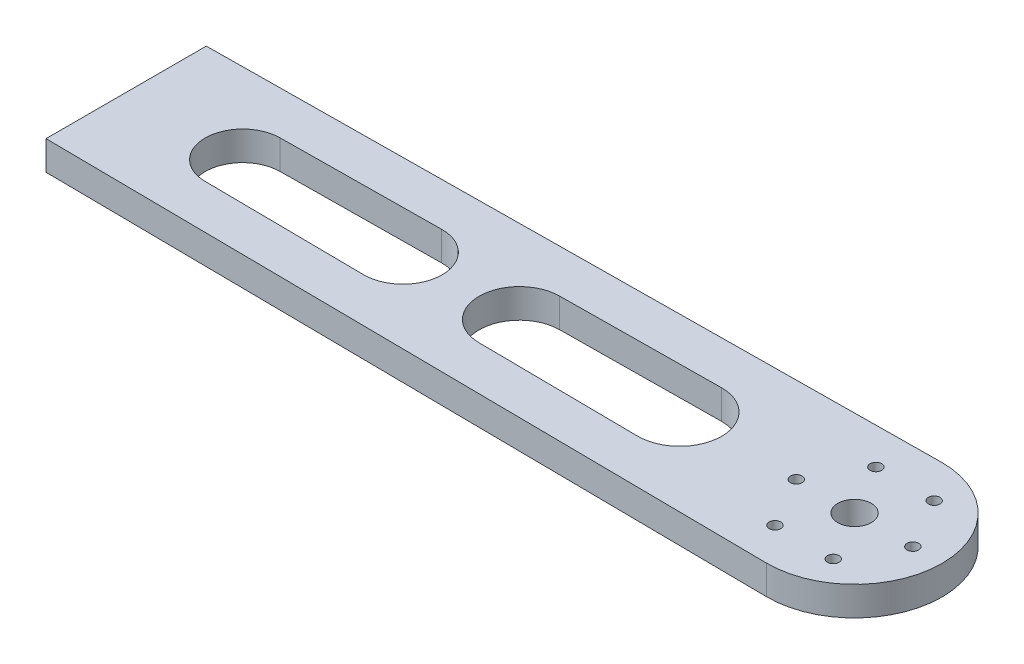
ISO-10303-21;
HEADER;
FILE_DESCRIPTION(('STEP AP214'),'2;1');
FILE_NAME('part.step','',(''),(''),'','','');
FILE_SCHEMA(('AUTOMOTIVE_DESIGN { 1 0 10303 214 1 1 1 1 }'));
ENDSEC;
DATA;
#1=APPLICATION_CONTEXT('core data for automotive mechanical design processes');
#2=APPLICATION_PROTOCOL_DEFINITION('international standard','automotive_design',2000,#1);
#3=PRODUCT_CONTEXT('',#1,'mechanical');
#4=PRODUCT('Part','Part','',(#3));
#5=PRODUCT_RELATED_PRODUCT_CATEGORY('part','',(#4));
#6=PRODUCT_DEFINITION_FORMATION('','',#4);
#7=PRODUCT_DEFINITION_CONTEXT('part definition',#1,'design');
#8=PRODUCT_DEFINITION('design','',#6,#7);
#9=PRODUCT_DEFINITION_SHAPE('','',#8);
#10=(LENGTH_UNIT() NAMED_UNIT(*) SI_UNIT(.MILLI.,.METRE.));
#11=(NAMED_UNIT(*) PLANE_ANGLE_UNIT() SI_UNIT($,.RADIAN.));
#12=(NAMED_UNIT(*) SI_UNIT($,.STERADIAN.) SOLID_ANGLE_UNIT());
#13=UNCERTAINTY_MEASURE_WITH_UNIT(LENGTH_MEASURE(1.E-05),#10,'distance_accuracy_value','');
#14=(GEOMETRIC_REPRESENTATION_CONTEXT(3) GLOBAL_UNCERTAINTY_ASSIGNED_CONTEXT((#13)) GLOBAL_UNIT_ASSIGNED_CONTEXT((#10,
#11,#12)) REPRESENTATION_CONTEXT('',''));
#15=CARTESIAN_POINT('',(0.,0.,0.));
#16=DIRECTION('',(0.,0.,1.));
#17=DIRECTION('',(1.,0.,0.));
#18=AXIS2_PLACEMENT_3D('',#15,#16,#17);
#19=CARTESIAN_POINT('',(33.6152394142152,10.,-9.95522460733301));
#20=DIRECTION('',(0.,1.,0.));
#21=DIRECTION('',(0.,0.,1.));
#22=AXIS2_PLACEMENT_3D('',#19,#20,#21);
#23=PLANE('',#22);
#24=DIRECTION('',(0.999948973181895,0.,0.0101020311063743));
#25=VECTOR('',#24,1.);
#26=CARTESIAN_POINT('',(-81.52466678409,10.,3.88233456528161));
#27=LINE('',#26,#25);
#28=CARTESIAN_POINT('',(-81.52466678409,10.,3.88233456528161));
#29=VERTEX_POINT('',#28);
#30=CARTESIAN_POINT('',(-26.5302262167507,10.,4.43791846424908));
#31=VERTEX_POINT('',#30);
#32=EDGE_CURVE('E132',#29,#31,#27,.T.);
#33=ORIENTED_EDGE('',*,*,#32,.F.);
#34=CARTESIAN_POINT('',(-81.3847600499998,10.,-9.96632553302472));
#35=DIRECTION('',(0.,1.,0.));
#36=DIRECTION('',(0.,0.,1.));
#37=AXIS2_PLACEMENT_3D('',#34,#35,#36);
#38=CIRCLE('',#37,13.8493667874263);
#39=CARTESIAN_POINT('',(-81.5219931650311,10.,-23.8150123835822));
#40=VERTEX_POINT('',#39);
#41=EDGE_CURVE('E124',#40,#29,#38,.T.);
#42=ORIENTED_EDGE('',*,*,#41,.F.);
#43=DIRECTION('',(-0.999950904840691,0.,0.00990898119298126));
#44=VECTOR('',#43,1.);
#45=CARTESIAN_POINT('',(-81.5219931650311,10.,-23.8150123835822));
#46=LINE('',#45,#44);
#47=CARTESIAN_POINT('',(-26.5274463617761,10.,-24.3599790687984));
#48=VERTEX_POINT('',#47);
#49=EDGE_CURVE('E147',#48,#40,#46,.T.);
#50=ORIENTED_EDGE('',*,*,#49,.F.);
#51=CARTESIAN_POINT('',(-26.3847603062448,10.,-9.96101639465042));
#52=DIRECTION('',(0.,1.,0.));
#53=DIRECTION('',(0.,0.,1.));
#54=AXIS2_PLACEMENT_3D('',#51,#52,#53);
#55=CIRCLE('',#54,14.3996696282224);
#56=EDGE_CURVE('E145',#31,#48,#55,.T.);
#57=ORIENTED_EDGE('',*,*,#56,.F.);
#58=EDGE_LOOP('',(#33,#42,#50,#57));
#59=FACE_BOUND('',#58,.T.);
#60=CARTESIAN_POINT('',(23.6152394142153,10.,-27.2757326830219));
#61=DIRECTION('',(0.,1.,0.));
#62=DIRECTION('',(0.,0.,1.));
#63=AXIS2_PLACEMENT_3D('',#60,#61,#62);
#64=CIRCLE('',#63,2.);
#65=CARTESIAN_POINT('',(23.6152394142153,10.,-25.2757326830219));
#66=VERTEX_POINT('',#65);
#67=EDGE_CURVE('E163',#66,#66,#64,.T.);
#68=ORIENTED_EDGE('',*,*,#67,.F.);
#69=EDGE_LOOP('',(#68));
#70=FACE_BOUND('',#69,.T.);
#71=CARTESIAN_POINT('',(23.6152394142151,10.,7.36528346835572));
#72=DIRECTION('',(0.,1.,0.));
#73=DIRECTION('',(0.,0.,1.));
#74=AXIS2_PLACEMENT_3D('',#71,#72,#73);
#75=CIRCLE('',#74,2.);
#76=CARTESIAN_POINT('',(23.6152394142151,10.,9.36528346835572));
#77=VERTEX_POINT('',#76);
#78=EDGE_CURVE('E175',#77,#77,#75,.T.);
#79=ORIENTED_EDGE('',*,*,#78,.F.);
#80=EDGE_LOOP('',(#79));
#81=FACE_BOUND('',#80,.T.);
#82=DIRECTION('',(-0.999950904840691,0.,0.00990898119298113));
#83=VECTOR('',#82,1.);
#84=CARTESIAN_POINT('',(-176.512574007017,10.,-22.873706290936));
#85=LINE('',#84,#83);
#86=CARTESIAN_POINT('',(-121.518027203762,10.,-23.4186729761523));
#87=VERTEX_POINT('',#86);
#88=CARTESIAN_POINT('',(-176.512574007017,10.,-22.873706290936));
#89=VERTEX_POINT('',#88);
#90=EDGE_CURVE('E189',#87,#89,#85,.T.);
#91=ORIENTED_EDGE('',*,*,#90,.F.);
#92=CARTESIAN_POINT('',(-121.38475986364,10.,-9.97018672456965));
#93=DIRECTION('',(0.,1.,0.));
#94=DIRECTION('',(0.,0.,1.));
#95=AXIS2_PLACEMENT_3D('',#92,#93,#94);
#96=CIRCLE('',#95,13.4491465395745);
#97=CARTESIAN_POINT('',(-121.520623560337,10.,3.47827354785072));
#98=VERTEX_POINT('',#97);
#99=EDGE_CURVE('E187',#98,#87,#96,.T.);
#100=ORIENTED_EDGE('',*,*,#99,.F.);
#101=DIRECTION('',(0.999948973181895,0.,0.0101020311063743));
#102=VECTOR('',#101,1.);
#103=CARTESIAN_POINT('',(-176.515064127676,10.,2.92268964888325));
#104=LINE('',#103,#102);
#105=CARTESIAN_POINT('',(-176.515064127676,10.,2.92268964888325));
#106=VERTEX_POINT('',#105);
#107=EDGE_CURVE('E195',#106,#98,#104,.T.);
#108=ORIENTED_EDGE('',*,*,#107,.F.);
#109=CARTESIAN_POINT('',(-176.384759607395,10.,-9.97549586294395));
#110=DIRECTION('',(0.,1.,0.));
#111=DIRECTION('',(0.,0.,1.));
#112=AXIS2_PLACEMENT_3D('',#109,#110,#111);
#113=CIRCLE('',#112,12.8988436987784);
#114=EDGE_CURVE('E192',#89,#106,#113,.T.);
#115=ORIENTED_EDGE('',*,*,#114,.F.);
#116=EDGE_LOOP('',(#91,#100,#108,#115));
#117=FACE_BOUND('',#116,.T.);
#118=CARTESIAN_POINT('',(53.6152394142152,10.,-9.95522460733301));
#119=DIRECTION('',(0.,1.,0.));
#120=DIRECTION('',(0.,0.,1.));
#121=AXIS2_PLACEMENT_3D('',#118,#119,#120);
#122=CIRCLE('',#121,2.);
#123=CARTESIAN_POINT('',(53.6152394142152,10.,-7.95522460733301));
#124=VERTEX_POINT('',#123);
#125=EDGE_CURVE('E218',#124,#124,#122,.T.);
#126=ORIENTED_EDGE('',*,*,#125,.F.);
#127=EDGE_LOOP('',(#126));
#128=FACE_BOUND('',#127,.T.);
#129=DIRECTION('',(-9.65297886194745E-05,0.,0.999999995341));
#130=VECTOR('',#129,1.);
#131=CARTESIAN_POINT('',(-216.382104851848,10.,-37.4793569263664));
#132=LINE('',#131,#130);
#133=CARTESIAN_POINT('',(-216.382104851848,10.,-37.4793569263664));
#134=VERTEX_POINT('',#133);
#135=CARTESIAN_POINT('',(-216.387413990222,10.,17.5206428173886));
#136=VERTEX_POINT('',#135);
#137=EDGE_CURVE('E230',#134,#136,#132,.T.);
#138=ORIENTED_EDGE('',*,*,#137,.T.);
#139=DIRECTION('',(0.999948973181895,0.,0.0101020311063743));
#140=VECTOR('',#139,1.);
#141=CARTESIAN_POINT('',(-216.387413990222,10.,17.5206428173886));
#142=LINE('',#141,#140);
#143=CARTESIAN_POINT('',(33.3121784810239,10.,20.0432445881238));
#144=VERTEX_POINT('',#143);
#145=EDGE_CURVE('E233',#136,#144,#142,.T.);
#146=ORIENTED_EDGE('',*,*,#145,.T.);
#147=CARTESIAN_POINT('',(33.6152394142152,10.,-9.95522460733301));
#148=DIRECTION('',(0.,1.,0.));
#149=DIRECTION('',(0.,0.,1.));
#150=AXIS2_PLACEMENT_3D('',#147,#148,#149);
#151=CIRCLE('',#150,30.);
#152=CARTESIAN_POINT('',(33.3179699784257,10.,-39.9537517525538));
#153=VERTEX_POINT('',#152);
#154=EDGE_CURVE('E236',#144,#153,#151,.T.);
#155=ORIENTED_EDGE('',*,*,#154,.T.);
#156=DIRECTION('',(-0.999950904840691,0.,0.00990898119298121));
#157=VECTOR('',#156,1.);
#158=CARTESIAN_POINT('',(-216.382104851848,10.,-37.4793569263664));
#159=LINE('',#158,#157);
#160=EDGE_CURVE('E238',#153,#134,#159,.T.);
#161=ORIENTED_EDGE('',*,*,#160,.T.);
#162=EDGE_LOOP('',(#138,#146,#155,#161));
#163=FACE_BOUND('',#162,.T.);
#164=CARTESIAN_POINT('',(33.6152394142152,10.,-9.95522460733301));
#165=DIRECTION('',(0.,1.,0.));
#166=DIRECTION('',(0.,0.,1.));
#167=AXIS2_PLACEMENT_3D('',#164,#165,#166);
#168=CIRCLE('',#167,5.75);
#169=CARTESIAN_POINT('',(33.6152394142152,10.,-4.20522460733302));
#170=VERTEX_POINT('',#169);
#171=EDGE_CURVE('E224',#170,#170,#168,.T.);
#172=ORIENTED_EDGE('',*,*,#171,.F.);
#173=EDGE_LOOP('',(#172));
#174=FACE_BOUND('',#173,.T.);
#175=CARTESIAN_POINT('',(43.6152394142151,10.,7.36528346835578));
#176=DIRECTION('',(0.,1.,0.));
#177=DIRECTION('',(0.,0.,1.));
#178=AXIS2_PLACEMENT_3D('',#175,#176,#177);
#179=CIRCLE('',#178,2.);
#180=CARTESIAN_POINT('',(43.6152394142151,10.,9.36528346835578));
#181=VERTEX_POINT('',#180);
#182=EDGE_CURVE('E181',#181,#181,#179,.T.);
#183=ORIENTED_EDGE('',*,*,#182,.F.);
#184=EDGE_LOOP('',(#183));
#185=FACE_BOUND('',#184,.T.);
#186=CARTESIAN_POINT('',(13.6152394142152,10.,-9.95522460733315));
#187=DIRECTION('',(0.,1.,0.));
#188=DIRECTION('',(0.,0.,1.));
#189=AXIS2_PLACEMENT_3D('',#186,#187,#188);
#190=CIRCLE('',#189,2.);
#191=CARTESIAN_POINT('',(13.6152394142152,10.,-7.95522460733315));
#192=VERTEX_POINT('',#191);
#193=EDGE_CURVE('E169',#192,#192,#190,.T.);
#194=ORIENTED_EDGE('',*,*,#193,.F.);
#195=EDGE_LOOP('',(#194));
#196=FACE_BOUND('',#195,.T.);
#197=CARTESIAN_POINT('',(43.6152394142154,10.,-27.2757326830217));
#198=DIRECTION('',(0.,1.,0.));
#199=DIRECTION('',(0.,0.,1.));
#200=AXIS2_PLACEMENT_3D('',#197,#198,#199);
#201=CIRCLE('',#200,2.);
#202=CARTESIAN_POINT('',(43.6152394142154,10.,-25.2757326830217));
#203=VERTEX_POINT('',#202);
#204=EDGE_CURVE('E153',#203,#203,#201,.T.);
#205=ORIENTED_EDGE('',*,*,#204,.F.);
#206=EDGE_LOOP('',(#205));
#207=FACE_BOUND('',#206,.T.);
#208=ADVANCED_FACE('F35',(#59,#70,#81,#117,#128,#163,#174,#185,#196,#207),#23,.T.);
#209=CARTESIAN_POINT('',(33.6152394142152,0.,-9.95522460733301));
#210=DIRECTION('',(0.,1.,0.));
#211=DIRECTION('',(0.,0.,1.));
#212=AXIS2_PLACEMENT_3D('',#209,#210,#211);
#213=PLANE('',#212);
#214=CARTESIAN_POINT('',(23.6152394142153,0.,-27.2757326830219));
#215=DIRECTION('',(0.,1.,0.));
#216=DIRECTION('',(0.,0.,1.));
#217=AXIS2_PLACEMENT_3D('',#214,#215,#216);
#218=CIRCLE('',#217,2.);
#219=CARTESIAN_POINT('',(23.6152394142153,0.,-25.2757326830219));
#220=VERTEX_POINT('',#219);
#221=EDGE_CURVE('E140',#220,#220,#218,.T.);
#222=ORIENTED_EDGE('',*,*,#221,.T.);
#223=EDGE_LOOP('',(#222));
#224=FACE_BOUND('',#223,.T.);
#225=CARTESIAN_POINT('',(13.6152394142152,0.,-9.95522460733315));
#226=DIRECTION('',(0.,1.,0.));
#227=DIRECTION('',(0.,0.,1.));
#228=AXIS2_PLACEMENT_3D('',#225,#226,#227);
#229=CIRCLE('',#228,2.);
#230=CARTESIAN_POINT('',(13.6152394142152,0.,-7.95522460733315));
#231=VERTEX_POINT('',#230);
#232=EDGE_CURVE('E166',#231,#231,#229,.T.);
#233=ORIENTED_EDGE('',*,*,#232,.T.);
#234=EDGE_LOOP('',(#233));
#235=FACE_BOUND('',#234,.T.);
#236=CARTESIAN_POINT('',(23.6152394142151,0.,7.36528346835572));
#237=DIRECTION('',(0.,1.,0.));
#238=DIRECTION('',(0.,0.,1.));
#239=AXIS2_PLACEMENT_3D('',#236,#237,#238);
#240=CIRCLE('',#239,2.);
#241=CARTESIAN_POINT('',(23.6152394142151,0.,9.36528346835572));
#242=VERTEX_POINT('',#241);
#243=EDGE_CURVE('E172',#242,#242,#240,.T.);
#244=ORIENTED_EDGE('',*,*,#243,.T.);
#245=EDGE_LOOP('',(#244));
#246=FACE_BOUND('',#245,.T.);
#247=CARTESIAN_POINT('',(43.6152394142151,0.,7.36528346835578));
#248=DIRECTION('',(0.,1.,0.));
#249=DIRECTION('',(0.,0.,1.));
#250=AXIS2_PLACEMENT_3D('',#247,#248,#249);
#251=CIRCLE('',#250,2.);
#252=CARTESIAN_POINT('',(43.6152394142151,0.,9.36528346835578));
#253=VERTEX_POINT('',#252);
#254=EDGE_CURVE('E178',#253,#253,#251,.T.);
#255=ORIENTED_EDGE('',*,*,#254,.T.);
#256=EDGE_LOOP('',(#255));
#257=FACE_BOUND('',#256,.T.);
#258=CARTESIAN_POINT('',(-121.38475986364,0.,-9.97018672456965));
#259=DIRECTION('',(0.,1.,0.));
#260=DIRECTION('',(0.,0.,1.));
#261=AXIS2_PLACEMENT_3D('',#258,#259,#260);
#262=CIRCLE('',#261,13.4491465395745);
#263=CARTESIAN_POINT('',(-121.520623560337,0.,3.47827354785072));
#264=VERTEX_POINT('',#263);
#265=CARTESIAN_POINT('',(-121.518027203762,0.,-23.4186729761523));
#266=VERTEX_POINT('',#265);
#267=EDGE_CURVE('E184',#264,#266,#262,.T.);
#268=ORIENTED_EDGE('',*,*,#267,.T.);
#269=DIRECTION('',(-0.999950904840691,0.,0.00990898119298113));
#270=VECTOR('',#269,1.);
#271=CARTESIAN_POINT('',(-176.512574007017,0.,-22.873706290936));
#272=LINE('',#271,#270);
#273=CARTESIAN_POINT('',(-176.512574007017,0.,-22.873706290936));
#274=VERTEX_POINT('',#273);
#275=EDGE_CURVE('E200',#266,#274,#272,.T.);
#276=ORIENTED_EDGE('',*,*,#275,.T.);
#277=CARTESIAN_POINT('',(-176.384759607395,0.,-9.97549586294395));
#278=DIRECTION('',(0.,1.,0.));
#279=DIRECTION('',(0.,0.,1.));
#280=AXIS2_PLACEMENT_3D('',#277,#278,#279);
#281=CIRCLE('',#280,12.8988436987784);
#282=CARTESIAN_POINT('',(-176.515064127676,0.,2.92268964888325));
#283=VERTEX_POINT('',#282);
#284=EDGE_CURVE('E203',#274,#283,#281,.T.);
#285=ORIENTED_EDGE('',*,*,#284,.T.);
#286=DIRECTION('',(0.999948973181895,0.,0.0101020311063743));
#287=VECTOR('',#286,1.);
#288=CARTESIAN_POINT('',(-176.515064127676,0.,2.92268964888325));
#289=LINE('',#288,#287);
#290=EDGE_CURVE('E190',#283,#264,#289,.T.);
#291=ORIENTED_EDGE('',*,*,#290,.T.);
#292=EDGE_LOOP('',(#268,#276,#285,#291));
#293=FACE_BOUND('',#292,.T.);
#294=DIRECTION('',(-9.65297886194745E-05,0.,0.999999995341));
#295=VECTOR('',#294,1.);
#296=CARTESIAN_POINT('',(-216.382104851848,0.,-37.4793569263664));
#297=LINE('',#296,#295);
#298=CARTESIAN_POINT('',(-216.382104851848,0.,-37.4793569263664));
#299=VERTEX_POINT('',#298);
#300=CARTESIAN_POINT('',(-216.387413990222,0.,17.5206428173886));
#301=VERTEX_POINT('',#300);
#302=EDGE_CURVE('E227',#299,#301,#297,.T.);
#303=ORIENTED_EDGE('',*,*,#302,.F.);
#304=DIRECTION('',(-0.999950904840691,0.,0.00990898119298121));
#305=VECTOR('',#304,1.);
#306=CARTESIAN_POINT('',(-216.382104851848,0.,-37.4793569263664));
#307=LINE('',#306,#305);
#308=CARTESIAN_POINT('',(33.3179699784257,0.,-39.9537517525538));
#309=VERTEX_POINT('',#308);
#310=EDGE_CURVE('E234',#309,#299,#307,.T.);
#311=ORIENTED_EDGE('',*,*,#310,.F.);
#312=CARTESIAN_POINT('',(33.6152394142152,0.,-9.95522460733301));
#313=DIRECTION('',(0.,1.,0.));
#314=DIRECTION('',(0.,0.,1.));
#315=AXIS2_PLACEMENT_3D('',#312,#313,#314);
#316=CIRCLE('',#315,30.);
#317=CARTESIAN_POINT('',(33.3121784810239,0.,20.0432445881238));
#318=VERTEX_POINT('',#317);
#319=EDGE_CURVE('E245',#318,#309,#316,.T.);
#320=ORIENTED_EDGE('',*,*,#319,.F.);
#321=DIRECTION('',(0.999948973181895,0.,0.0101020311063743));
#322=VECTOR('',#321,1.);
#323=CARTESIAN_POINT('',(-216.387413990222,0.,17.5206428173886));
#324=LINE('',#323,#322);
#325=EDGE_CURVE('E243',#301,#318,#324,.T.);
#326=ORIENTED_EDGE('',*,*,#325,.F.);
#327=EDGE_LOOP('',(#303,#311,#320,#326));
#328=FACE_BOUND('',#327,.T.);
#329=CARTESIAN_POINT('',(33.6152394142152,0.,-9.95522460733301));
#330=DIRECTION('',(0.,1.,0.));
#331=DIRECTION('',(0.,0.,1.));
#332=AXIS2_PLACEMENT_3D('',#329,#330,#331);
#333=CIRCLE('',#332,5.75);
#334=CARTESIAN_POINT('',(33.6152394142152,0.,-4.20522460733302));
#335=VERTEX_POINT('',#334);
#336=EDGE_CURVE('E221',#335,#335,#333,.T.);
#337=ORIENTED_EDGE('',*,*,#336,.T.);
#338=EDGE_LOOP('',(#337));
#339=FACE_BOUND('',#338,.T.);
#340=CARTESIAN_POINT('',(53.6152394142152,0.,-9.95522460733301));
#341=DIRECTION('',(0.,1.,0.));
#342=DIRECTION('',(0.,0.,1.));
#343=AXIS2_PLACEMENT_3D('',#340,#341,#342);
#344=CIRCLE('',#343,2.);
#345=CARTESIAN_POINT('',(53.6152394142152,0.,-7.95522460733301));
#346=VERTEX_POINT('',#345);
#347=EDGE_CURVE('E217',#346,#346,#344,.T.);
#348=ORIENTED_EDGE('',*,*,#347,.T.);
#349=EDGE_LOOP('',(#348));
#350=FACE_BOUND('',#349,.T.);
#351=CARTESIAN_POINT('',(-81.3847600499998,0.,-9.96632553302472));
#352=DIRECTION('',(0.,1.,0.));
#353=DIRECTION('',(0.,0.,1.));
#354=AXIS2_PLACEMENT_3D('',#351,#352,#353);
#355=CIRCLE('',#354,13.8493667874263);
#356=CARTESIAN_POINT('',(-81.5219931650311,0.,-23.8150123835822));
#357=VERTEX_POINT('',#356);
#358=CARTESIAN_POINT('',(-81.52466678409,0.,3.88233456528161));
#359=VERTEX_POINT('',#358);
#360=EDGE_CURVE('E58',#357,#359,#355,.T.);
#361=ORIENTED_EDGE('',*,*,#360,.T.);
#362=DIRECTION('',(0.999948973181895,0.,0.0101020311063743));
#363=VECTOR('',#362,1.);
#364=CARTESIAN_POINT('',(-81.52466678409,0.,3.88233456528161));
#365=LINE('',#364,#363);
#366=CARTESIAN_POINT('',(-26.5302262167507,0.,4.43791846424908));
#367=VERTEX_POINT('',#366);
#368=EDGE_CURVE('E139',#359,#367,#365,.T.);
#369=ORIENTED_EDGE('',*,*,#368,.T.);
#370=CARTESIAN_POINT('',(-26.3847603062448,0.,-9.96101639465042));
#371=DIRECTION('',(0.,1.,0.));
#372=DIRECTION('',(0.,0.,1.));
#373=AXIS2_PLACEMENT_3D('',#370,#371,#372);
#374=CIRCLE('',#373,14.3996696282224);
#375=CARTESIAN_POINT('',(-26.5274463617761,0.,-24.3599790687984));
#376=VERTEX_POINT('',#375);
#377=EDGE_CURVE('E155',#367,#376,#374,.T.);
#378=ORIENTED_EDGE('',*,*,#377,.T.);
#379=DIRECTION('',(-0.999950904840691,0.,0.00990898119298126));
#380=VECTOR('',#379,1.);
#381=CARTESIAN_POINT('',(-81.5219931650311,0.,-23.8150123835822));
#382=LINE('',#381,#380);
#383=EDGE_CURVE('E133',#376,#357,#382,.T.);
#384=ORIENTED_EDGE('',*,*,#383,.T.);
#385=EDGE_LOOP('',(#361,#369,#378,#384));
#386=FACE_BOUND('',#385,.T.);
#387=CARTESIAN_POINT('',(43.6152394142154,0.,-27.2757326830217));
#388=DIRECTION('',(0.,1.,0.));
#389=DIRECTION('',(0.,0.,1.));
#390=AXIS2_PLACEMENT_3D('',#387,#388,#389);
#391=CIRCLE('',#390,2.);
#392=CARTESIAN_POINT('',(43.6152394142154,0.,-25.2757326830217));
#393=VERTEX_POINT('',#392);
#394=EDGE_CURVE('E312',#393,#393,#391,.T.);
#395=ORIENTED_EDGE('',*,*,#394,.T.);
#396=EDGE_LOOP('',(#395));
#397=FACE_BOUND('',#396,.T.);
#398=ADVANCED_FACE('F263',(#224,#235,#246,#257,#293,#328,#339,#350,#386,#397),#213,.F.);
#399=CARTESIAN_POINT('',(-216.382104851848,10.,-37.4793569263664));
#400=DIRECTION('',(0.999999995341,0.,9.65297886194745E-05));
#401=DIRECTION('',(9.65297886194745E-05,0.,-0.999999995341));
#402=AXIS2_PLACEMENT_3D('',#399,#400,#401);
#403=PLANE('',#402);
#404=ORIENTED_EDGE('',*,*,#302,.T.);
#405=DIRECTION('',(0.,-1.,0.));
#406=VECTOR('',#405,1.);
#407=CARTESIAN_POINT('',(-216.387413990222,10.,17.5206428173886));
#408=LINE('',#407,#406);
#409=EDGE_CURVE('E11',#136,#301,#408,.T.);
#410=ORIENTED_EDGE('',*,*,#409,.F.);
#411=ORIENTED_EDGE('',*,*,#137,.F.);
#412=DIRECTION('',(0.,-1.,0.));
#413=VECTOR('',#412,1.);
#414=CARTESIAN_POINT('',(-216.382104851848,10.,-37.4793569263664));
#415=LINE('',#414,#413);
#416=EDGE_CURVE('E240',#134,#299,#415,.T.);
#417=ORIENTED_EDGE('',*,*,#416,.T.);
#418=EDGE_LOOP('',(#404,#410,#411,#417));
#419=FACE_BOUND('',#418,.T.);
#420=ADVANCED_FACE('F37',(#419),#403,.F.);
#421=CARTESIAN_POINT('',(-216.387413990222,10.,17.5206428173886));
#422=DIRECTION('',(0.0101020311063743,0.,-0.999948973181895));
#423=DIRECTION('',(-0.999948973181895,0.,-0.0101020311063743));
#424=AXIS2_PLACEMENT_3D('',#421,#422,#423);
#425=PLANE('',#424);
#426=ORIENTED_EDGE('',*,*,#325,.T.);
#427=DIRECTION('',(0.,-1.,0.));
#428=VECTOR('',#427,1.);
#429=CARTESIAN_POINT('',(33.3121784810239,10.,20.0432445881238));
#430=LINE('',#429,#428);
#431=EDGE_CURVE('E43',#144,#318,#430,.T.);
#432=ORIENTED_EDGE('',*,*,#431,.F.);
#433=ORIENTED_EDGE('',*,*,#145,.F.);
#434=ORIENTED_EDGE('',*,*,#409,.T.);
#435=EDGE_LOOP('',(#426,#432,#433,#434));
#436=FACE_BOUND('',#435,.T.);
#437=ADVANCED_FACE('F274',(#436),#425,.F.);
#438=CARTESIAN_POINT('',(33.6152394142152,10.,-9.95522460733301));
#439=DIRECTION('',(0.,-1.,0.));
#440=DIRECTION('',(0.,0.,-1.));
#441=AXIS2_PLACEMENT_3D('',#438,#439,#440);
#442=CYLINDRICAL_SURFACE('',#441,30.);
#443=ORIENTED_EDGE('',*,*,#319,.T.);
#444=DIRECTION('',(0.,-1.,0.));
#445=VECTOR('',#444,1.);
#446=CARTESIAN_POINT('',(33.3179699784257,10.,-39.9537517525538));
#447=LINE('',#446,#445);
#448=EDGE_CURVE('E250',#153,#309,#447,.T.);
#449=ORIENTED_EDGE('',*,*,#448,.F.);
#450=ORIENTED_EDGE('',*,*,#154,.F.);
#451=ORIENTED_EDGE('',*,*,#431,.T.);
#452=EDGE_LOOP('',(#443,#449,#450,#451));
#453=FACE_BOUND('',#452,.T.);
#454=ADVANCED_FACE('F257',(#453),#442,.T.);
#455=CARTESIAN_POINT('',(-216.382104851848,10.,-37.4793569263664));
#456=DIRECTION('',(0.00990898119298121,0.,0.999950904840691));
#457=DIRECTION('',(0.999950904840691,0.,-0.00990898119298121));
#458=AXIS2_PLACEMENT_3D('',#455,#456,#457);
#459=PLANE('',#458);
#460=ORIENTED_EDGE('',*,*,#310,.T.);
#461=ORIENTED_EDGE('',*,*,#416,.F.);
#462=ORIENTED_EDGE('',*,*,#160,.F.);
#463=ORIENTED_EDGE('',*,*,#448,.T.);
#464=EDGE_LOOP('',(#460,#461,#462,#463));
#465=FACE_BOUND('',#464,.T.);
#466=ADVANCED_FACE('F267',(#465),#459,.F.);
#467=CARTESIAN_POINT('',(33.6152394142152,10.,-9.95522460733301));
#468=DIRECTION('',(0.,-1.,0.));
#469=DIRECTION('',(0.,0.,-1.));
#470=AXIS2_PLACEMENT_3D('',#467,#468,#469);
#471=CYLINDRICAL_SURFACE('',#470,5.75);
#472=ORIENTED_EDGE('',*,*,#171,.T.);
#473=EDGE_LOOP('',(#472));
#474=FACE_BOUND('',#473,.T.);
#475=ORIENTED_EDGE('',*,*,#336,.F.);
#476=EDGE_LOOP('',(#475));
#477=FACE_BOUND('',#476,.T.);
#478=ADVANCED_FACE('F289',(#474,#477),#471,.F.);
#479=CARTESIAN_POINT('',(53.6152394142152,10.,-9.95522460733301));
#480=DIRECTION('',(0.,-1.,0.));
#481=DIRECTION('',(0.,0.,-1.));
#482=AXIS2_PLACEMENT_3D('',#479,#480,#481);
#483=CYLINDRICAL_SURFACE('',#482,2.);
#484=ORIENTED_EDGE('',*,*,#125,.T.);
#485=EDGE_LOOP('',(#484));
#486=FACE_BOUND('',#485,.T.);
#487=ORIENTED_EDGE('',*,*,#347,.F.);
#488=EDGE_LOOP('',(#487));
#489=FACE_BOUND('',#488,.T.);
#490=ADVANCED_FACE('F296',(#486,#489),#483,.F.);
#491=CARTESIAN_POINT('',(-121.38475986364,10.,-9.97018672456965));
#492=DIRECTION('',(0.,-1.,0.));
#493=DIRECTION('',(0.,0.,-1.));
#494=AXIS2_PLACEMENT_3D('',#491,#492,#493);
#495=CYLINDRICAL_SURFACE('',#494,13.4491465395745);
#496=ORIENTED_EDGE('',*,*,#267,.F.);
#497=DIRECTION('',(0.,-1.,0.));
#498=VECTOR('',#497,1.);
#499=CARTESIAN_POINT('',(-121.520623560337,10.,3.47827354785072));
#500=LINE('',#499,#498);
#501=EDGE_CURVE('E197',#98,#264,#500,.T.);
#502=ORIENTED_EDGE('',*,*,#501,.F.);
#503=ORIENTED_EDGE('',*,*,#99,.T.);
#504=DIRECTION('',(0.,-1.,0.));
#505=VECTOR('',#504,1.);
#506=CARTESIAN_POINT('',(-121.518027203762,10.,-23.4186729761523));
#507=LINE('',#506,#505);
#508=EDGE_CURVE('E214',#87,#266,#507,.T.);
#509=ORIENTED_EDGE('',*,*,#508,.T.);
#510=EDGE_LOOP('',(#496,#502,#503,#509));
#511=FACE_BOUND('',#510,.T.);
#512=ADVANCED_FACE('F301',(#511),#495,.F.);
#513=CARTESIAN_POINT('',(-176.512574007017,10.,-22.873706290936));
#514=DIRECTION('',(0.00990898119298113,0.,0.999950904840691));
#515=DIRECTION('',(0.999950904840691,0.,-0.00990898119298113));
#516=AXIS2_PLACEMENT_3D('',#513,#514,#515);
#517=PLANE('',#516);
#518=ORIENTED_EDGE('',*,*,#275,.F.);
#519=ORIENTED_EDGE('',*,*,#508,.F.);
#520=ORIENTED_EDGE('',*,*,#90,.T.);
#521=DIRECTION('',(0.,-1.,0.));
#522=VECTOR('',#521,1.);
#523=CARTESIAN_POINT('',(-176.512574007017,10.,-22.873706290936));
#524=LINE('',#523,#522);
#525=EDGE_CURVE('E212',#89,#274,#524,.T.);
#526=ORIENTED_EDGE('',*,*,#525,.T.);
#527=EDGE_LOOP('',(#518,#519,#520,#526));
#528=FACE_BOUND('',#527,.T.);
#529=ADVANCED_FACE('F359',(#528),#517,.T.);
#530=CARTESIAN_POINT('',(-176.384759607395,10.,-9.97549586294395));
#531=DIRECTION('',(0.,-1.,0.));
#532=DIRECTION('',(0.,0.,-1.));
#533=AXIS2_PLACEMENT_3D('',#530,#531,#532);
#534=CYLINDRICAL_SURFACE('',#533,12.8988436987784);
#535=ORIENTED_EDGE('',*,*,#284,.F.);
#536=ORIENTED_EDGE('',*,*,#525,.F.);
#537=ORIENTED_EDGE('',*,*,#114,.T.);
#538=DIRECTION('',(0.,-1.,0.));
#539=VECTOR('',#538,1.);
#540=CARTESIAN_POINT('',(-176.515064127676,10.,2.92268964888325));
#541=LINE('',#540,#539);
#542=EDGE_CURVE('E210',#106,#283,#541,.T.);
#543=ORIENTED_EDGE('',*,*,#542,.T.);
#544=EDGE_LOOP('',(#535,#536,#537,#543));
#545=FACE_BOUND('',#544,.T.);
#546=ADVANCED_FACE('F355',(#545),#534,.F.);
#547=CARTESIAN_POINT('',(-176.515064127676,10.,2.92268964888325));
#548=DIRECTION('',(0.0101020311063743,0.,-0.999948973181895));
#549=DIRECTION('',(-0.999948973181895,0.,-0.0101020311063743));
#550=AXIS2_PLACEMENT_3D('',#547,#548,#549);
#551=PLANE('',#550);
#552=ORIENTED_EDGE('',*,*,#290,.F.);
#553=ORIENTED_EDGE('',*,*,#542,.F.);
#554=ORIENTED_EDGE('',*,*,#107,.T.);
#555=ORIENTED_EDGE('',*,*,#501,.T.);
#556=EDGE_LOOP('',(#552,#553,#554,#555));
#557=FACE_BOUND('',#556,.T.);
#558=ADVANCED_FACE('F351',(#557),#551,.T.);
#559=CARTESIAN_POINT('',(43.6152394142151,10.,7.36528346835578));
#560=DIRECTION('',(0.,-1.,0.));
#561=DIRECTION('',(0.,0.,-1.));
#562=AXIS2_PLACEMENT_3D('',#559,#560,#561);
#563=CYLINDRICAL_SURFACE('',#562,2.);
#564=ORIENTED_EDGE('',*,*,#182,.T.);
#565=EDGE_LOOP('',(#564));
#566=FACE_BOUND('',#565,.T.);
#567=ORIENTED_EDGE('',*,*,#254,.F.);
#568=EDGE_LOOP('',(#567));
#569=FACE_BOUND('',#568,.T.);
#570=ADVANCED_FACE('F347',(#566,#569),#563,.F.);
#571=CARTESIAN_POINT('',(23.6152394142151,10.,7.36528346835572));
#572=DIRECTION('',(0.,-1.,0.));
#573=DIRECTION('',(0.,0.,-1.));
#574=AXIS2_PLACEMENT_3D('',#571,#572,#573);
#575=CYLINDRICAL_SURFACE('',#574,2.);
#576=ORIENTED_EDGE('',*,*,#78,.T.);
#577=EDGE_LOOP('',(#576));
#578=FACE_BOUND('',#577,.T.);
#579=ORIENTED_EDGE('',*,*,#243,.F.);
#580=EDGE_LOOP('',(#579));
#581=FACE_BOUND('',#580,.T.);
#582=ADVANCED_FACE('F343',(#578,#581),#575,.F.);
#583=CARTESIAN_POINT('',(13.6152394142152,10.,-9.95522460733315));
#584=DIRECTION('',(0.,-1.,0.));
#585=DIRECTION('',(0.,0.,-1.));
#586=AXIS2_PLACEMENT_3D('',#583,#584,#585);
#587=CYLINDRICAL_SURFACE('',#586,2.);
#588=ORIENTED_EDGE('',*,*,#193,.T.);
#589=EDGE_LOOP('',(#588));
#590=FACE_BOUND('',#589,.T.);
#591=ORIENTED_EDGE('',*,*,#232,.F.);
#592=EDGE_LOOP('',(#591));
#593=FACE_BOUND('',#592,.T.);
#594=ADVANCED_FACE('F339',(#590,#593),#587,.F.);
#595=CARTESIAN_POINT('',(23.6152394142153,10.,-27.2757326830219));
#596=DIRECTION('',(0.,-1.,0.));
#597=DIRECTION('',(0.,0.,-1.));
#598=AXIS2_PLACEMENT_3D('',#595,#596,#597);
#599=CYLINDRICAL_SURFACE('',#598,2.);
#600=ORIENTED_EDGE('',*,*,#67,.T.);
#601=EDGE_LOOP('',(#600));
#602=FACE_BOUND('',#601,.T.);
#603=ORIENTED_EDGE('',*,*,#221,.F.);
#604=EDGE_LOOP('',(#603));
#605=FACE_BOUND('',#604,.T.);
#606=ADVANCED_FACE('F336',(#602,#605),#599,.F.);
#607=CARTESIAN_POINT('',(-81.3847600499998,10.,-9.96632553302472));
#608=DIRECTION('',(0.,-1.,0.));
#609=DIRECTION('',(0.,0.,-1.));
#610=AXIS2_PLACEMENT_3D('',#607,#608,#609);
#611=CYLINDRICAL_SURFACE('',#610,13.8493667874263);
#612=ORIENTED_EDGE('',*,*,#360,.F.);
#613=DIRECTION('',(0.,-1.,0.));
#614=VECTOR('',#613,1.);
#615=CARTESIAN_POINT('',(-81.5219931650311,10.,-23.8150123835822));
#616=LINE('',#615,#614);
#617=EDGE_CURVE('E128',#40,#357,#616,.T.);
#618=ORIENTED_EDGE('',*,*,#617,.F.);
#619=ORIENTED_EDGE('',*,*,#41,.T.);
#620=DIRECTION('',(0.,-1.,0.));
#621=VECTOR('',#620,1.);
#622=CARTESIAN_POINT('',(-81.52466678409,10.,3.88233456528161));
#623=LINE('',#622,#621);
#624=EDGE_CURVE('E127',#29,#359,#623,.T.);
#625=ORIENTED_EDGE('',*,*,#624,.T.);
#626=EDGE_LOOP('',(#612,#618,#619,#625));
#627=FACE_BOUND('',#626,.T.);
#628=ADVANCED_FACE('F126',(#627),#611,.F.);
#629=CARTESIAN_POINT('',(-81.52466678409,10.,3.88233456528161));
#630=DIRECTION('',(0.0101020311063743,0.,-0.999948973181895));
#631=DIRECTION('',(-0.999948973181895,0.,-0.0101020311063743));
#632=AXIS2_PLACEMENT_3D('',#629,#630,#631);
#633=PLANE('',#632);
#634=ORIENTED_EDGE('',*,*,#368,.F.);
#635=ORIENTED_EDGE('',*,*,#624,.F.);
#636=ORIENTED_EDGE('',*,*,#32,.T.);
#637=DIRECTION('',(0.,-1.,0.));
#638=VECTOR('',#637,1.);
#639=CARTESIAN_POINT('',(-26.5302262167507,10.,4.43791846424908));
#640=LINE('',#639,#638);
#641=EDGE_CURVE('E141',#31,#367,#640,.T.);
#642=ORIENTED_EDGE('',*,*,#641,.T.);
#643=EDGE_LOOP('',(#634,#635,#636,#642));
#644=FACE_BOUND('',#643,.T.);
#645=ADVANCED_FACE('F136',(#644),#633,.T.);
#646=CARTESIAN_POINT('',(-26.3847603062448,10.,-9.96101639465042));
#647=DIRECTION('',(0.,-1.,0.));
#648=DIRECTION('',(0.,0.,-1.));
#649=AXIS2_PLACEMENT_3D('',#646,#647,#648);
#650=CYLINDRICAL_SURFACE('',#649,14.3996696282224);
#651=ORIENTED_EDGE('',*,*,#377,.F.);
#652=ORIENTED_EDGE('',*,*,#641,.F.);
#653=ORIENTED_EDGE('',*,*,#56,.T.);
#654=DIRECTION('',(0.,-1.,0.));
#655=VECTOR('',#654,1.);
#656=CARTESIAN_POINT('',(-26.5274463617761,10.,-24.3599790687984));
#657=LINE('',#656,#655);
#658=EDGE_CURVE('E50',#48,#376,#657,.T.);
#659=ORIENTED_EDGE('',*,*,#658,.T.);
#660=EDGE_LOOP('',(#651,#652,#653,#659));
#661=FACE_BOUND('',#660,.T.);
#662=ADVANCED_FACE('F326',(#661),#650,.F.);
#663=CARTESIAN_POINT('',(-81.5219931650311,10.,-23.8150123835822));
#664=DIRECTION('',(0.00990898119298126,0.,0.999950904840691));
#665=DIRECTION('',(0.999950904840691,0.,-0.00990898119298126));
#666=AXIS2_PLACEMENT_3D('',#663,#664,#665);
#667=PLANE('',#666);
#668=ORIENTED_EDGE('',*,*,#383,.F.);
#669=ORIENTED_EDGE('',*,*,#658,.F.);
#670=ORIENTED_EDGE('',*,*,#49,.T.);
#671=ORIENTED_EDGE('',*,*,#617,.T.);
#672=EDGE_LOOP('',(#668,#669,#670,#671));
#673=FACE_BOUND('',#672,.T.);
#674=ADVANCED_FACE('F321',(#673),#667,.T.);
#675=CARTESIAN_POINT('',(43.6152394142154,10.,-27.2757326830217));
#676=DIRECTION('',(0.,-1.,0.));
#677=DIRECTION('',(0.,0.,-1.));
#678=AXIS2_PLACEMENT_3D('',#675,#676,#677);
#679=CYLINDRICAL_SURFACE('',#678,2.);
#680=ORIENTED_EDGE('',*,*,#204,.T.);
#681=EDGE_LOOP('',(#680));
#682=FACE_BOUND('',#681,.T.);
#683=ORIENTED_EDGE('',*,*,#394,.F.);
#684=EDGE_LOOP('',(#683));
#685=FACE_BOUND('',#684,.T.);
#686=ADVANCED_FACE('F318',(#682,#685),#679,.F.);
#687=CLOSED_SHELL('',(#208,#398,#420,#437,#454,#466,#478,#490,#512,#529,#546,#558,#570,#582,
#594,#606,#628,#645,#662,#674,#686));
#688=MANIFOLD_SOLID_BREP('B2',#687);
#689=ADVANCED_BREP_SHAPE_REPRESENTATION('',(#18,#688),#14);
#690=SHAPE_DEFINITION_REPRESENTATION(#9,#689);
ENDSEC;
END-ISO-10303-21;
